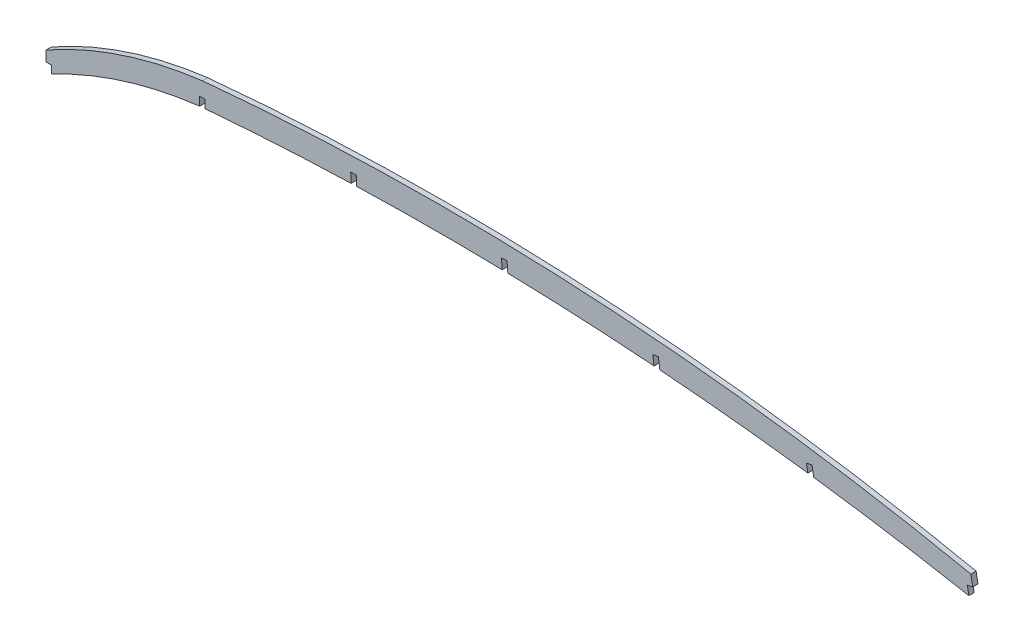
ISO-10303-21;
HEADER;
FILE_DESCRIPTION(('STEP AP214'),'2;1');
FILE_NAME('part.step','',(''),(''),'','','');
FILE_SCHEMA(('AUTOMOTIVE_DESIGN { 1 0 10303 214 1 1 1 1 }'));
ENDSEC;
DATA;
#1=APPLICATION_CONTEXT('core data for automotive mechanical design processes');
#2=APPLICATION_PROTOCOL_DEFINITION('international standard','automotive_design',2000,#1);
#3=PRODUCT_CONTEXT('',#1,'mechanical');
#4=PRODUCT('Part','Part','',(#3));
#5=PRODUCT_RELATED_PRODUCT_CATEGORY('part','',(#4));
#6=PRODUCT_DEFINITION_FORMATION('','',#4);
#7=PRODUCT_DEFINITION_CONTEXT('part definition',#1,'design');
#8=PRODUCT_DEFINITION('design','',#6,#7);
#9=PRODUCT_DEFINITION_SHAPE('','',#8);
#10=(LENGTH_UNIT() NAMED_UNIT(*) SI_UNIT(.MILLI.,.METRE.));
#11=(NAMED_UNIT(*) PLANE_ANGLE_UNIT() SI_UNIT($,.RADIAN.));
#12=(NAMED_UNIT(*) SI_UNIT($,.STERADIAN.) SOLID_ANGLE_UNIT());
#13=UNCERTAINTY_MEASURE_WITH_UNIT(LENGTH_MEASURE(1.E-05),#10,'distance_accuracy_value','');
#14=(GEOMETRIC_REPRESENTATION_CONTEXT(3) GLOBAL_UNCERTAINTY_ASSIGNED_CONTEXT((#13)) GLOBAL_UNIT_ASSIGNED_CONTEXT((#10,
#11,#12)) REPRESENTATION_CONTEXT('',''));
#15=CARTESIAN_POINT('',(0.,0.,0.));
#16=DIRECTION('',(0.,0.,1.));
#17=DIRECTION('',(1.,0.,0.));
#18=AXIS2_PLACEMENT_3D('',#15,#16,#17);
#19=CARTESIAN_POINT('',(236.848565858002,-1577.85111526632,3.175));
#20=DIRECTION('',(0.,0.,-1.));
#21=DIRECTION('',(-1.,0.,0.));
#22=AXIS2_PLACEMENT_3D('',#19,#20,#21);
#23=CYLINDRICAL_SURFACE('',#22,1707.63280925276);
#24=CARTESIAN_POINT('',(236.848565858002,-1577.85111526632,0.));
#25=DIRECTION('',(0.,0.,1.));
#26=DIRECTION('',(1.,0.,0.));
#27=AXIS2_PLACEMENT_3D('',#24,#25,#26);
#28=CIRCLE('',#27,1707.63280925276);
#29=CARTESIAN_POINT('',(186.671482616281,129.044333070749,0.));
#30=VERTEX_POINT('',#29);
#31=CARTESIAN_POINT('',(274.098105392822,129.375373235102,0.));
#32=VERTEX_POINT('',#31);
#33=EDGE_CURVE('E373',#30,#32,#28,.F.);
#34=ORIENTED_EDGE('',*,*,#33,.T.);
#35=DIRECTION('',(0.,0.,-1.));
#36=VECTOR('',#35,1.);
#37=CARTESIAN_POINT('',(274.098105392822,129.375373235101,3.175));
#38=LINE('',#37,#36);
#39=CARTESIAN_POINT('',(274.098105392822,129.375373235102,3.175));
#40=VERTEX_POINT('',#39);
#41=EDGE_CURVE('E299',#32,#40,#38,.F.);
#42=ORIENTED_EDGE('',*,*,#41,.T.);
#43=CARTESIAN_POINT('',(236.848565858002,-1577.85111526632,3.175));
#44=DIRECTION('',(0.,0.,1.));
#45=DIRECTION('',(1.,0.,0.));
#46=AXIS2_PLACEMENT_3D('',#43,#44,#45);
#47=CIRCLE('',#46,1707.63280925276);
#48=CARTESIAN_POINT('',(186.671482616281,129.044333070749,3.175));
#49=VERTEX_POINT('',#48);
#50=EDGE_CURVE('E375',#49,#40,#47,.F.);
#51=ORIENTED_EDGE('',*,*,#50,.F.);
#52=DIRECTION('',(0.,0.,-1.));
#53=VECTOR('',#52,1.);
#54=CARTESIAN_POINT('',(186.671482616281,129.044333070749,3.175));
#55=LINE('',#54,#53);
#56=EDGE_CURVE('E306',#49,#30,#55,.T.);
#57=ORIENTED_EDGE('',*,*,#56,.T.);
#58=EDGE_LOOP('',(#34,#42,#51,#57));
#59=FACE_BOUND('',#58,.T.);
#60=ADVANCED_FACE('F39',(#59),#23,.F.);
#61=CARTESIAN_POINT('',(95.6691,123.93564271968,0.));
#62=VERTEX_POINT('',#61);
#63=CARTESIAN_POINT('',(183.294622404811,128.941721130957,0.));
#64=VERTEX_POINT('',#63);
#65=EDGE_CURVE('E333',#62,#64,#28,.F.);
#66=ORIENTED_EDGE('',*,*,#65,.T.);
#67=DIRECTION('',(0.,0.,-1.));
#68=VECTOR('',#67,1.);
#69=CARTESIAN_POINT('',(183.294622404811,128.941721130957,3.175));
#70=LINE('',#69,#68);
#71=CARTESIAN_POINT('',(183.294622404811,128.941721130957,3.175));
#72=VERTEX_POINT('',#71);
#73=EDGE_CURVE('E300',#64,#72,#70,.F.);
#74=ORIENTED_EDGE('',*,*,#73,.T.);
#75=CARTESIAN_POINT('',(95.6691,123.93564271968,3.175));
#76=VERTEX_POINT('',#75);
#77=EDGE_CURVE('E316',#76,#72,#47,.F.);
#78=ORIENTED_EDGE('',*,*,#77,.F.);
#79=DIRECTION('',(0.,0.,-1.));
#80=VECTOR('',#79,1.);
#81=CARTESIAN_POINT('',(95.6691,123.93564271968,3.175));
#82=LINE('',#81,#80);
#83=EDGE_CURVE('E363',#76,#62,#82,.T.);
#84=ORIENTED_EDGE('',*,*,#83,.T.);
#85=EDGE_LOOP('',(#66,#74,#78,#84));
#86=FACE_BOUND('',#85,.T.);
#87=ADVANCED_FACE('F518',(#86),#23,.F.);
#88=CARTESIAN_POINT('',(368.77346378483,124.678071720924,0.));
#89=VERTEX_POINT('',#88);
#90=CARTESIAN_POINT('',(457.732770478867,115.435623412471,0.));
#91=VERTEX_POINT('',#90);
#92=EDGE_CURVE('E332',#89,#91,#28,.F.);
#93=ORIENTED_EDGE('',*,*,#92,.T.);
#94=DIRECTION('',(0.,0.,-1.));
#95=VECTOR('',#94,1.);
#96=CARTESIAN_POINT('',(457.732770478868,115.435623412472,3.175));
#97=LINE('',#96,#95);
#98=CARTESIAN_POINT('',(457.732770478867,115.435623412471,3.175));
#99=VERTEX_POINT('',#98);
#100=EDGE_CURVE('E360',#91,#99,#97,.F.);
#101=ORIENTED_EDGE('',*,*,#100,.T.);
#102=CARTESIAN_POINT('',(368.77346378483,124.678071720924,3.175));
#103=VERTEX_POINT('',#102);
#104=EDGE_CURVE('E315',#103,#99,#47,.F.);
#105=ORIENTED_EDGE('',*,*,#104,.F.);
#106=DIRECTION('',(0.,0.,-1.));
#107=VECTOR('',#106,1.);
#108=CARTESIAN_POINT('',(368.77346378483,124.678071720924,3.175));
#109=LINE('',#108,#107);
#110=EDGE_CURVE('E238',#103,#89,#109,.T.);
#111=ORIENTED_EDGE('',*,*,#110,.T.);
#112=EDGE_LOOP('',(#93,#101,#105,#111));
#113=FACE_BOUND('',#112,.T.);
#114=ADVANCED_FACE('F386',(#113),#23,.F.);
#115=CARTESIAN_POINT('',(277.495469966465,129.29786488241,3.175));
#116=VERTEX_POINT('',#115);
#117=CARTESIAN_POINT('',(365.330558587539,124.941352646519,3.175));
#118=VERTEX_POINT('',#117);
#119=EDGE_CURVE('E298',#116,#118,#47,.F.);
#120=ORIENTED_EDGE('',*,*,#119,.F.);
#121=DIRECTION('',(0.,0.,-1.));
#122=VECTOR('',#121,1.);
#123=CARTESIAN_POINT('',(277.495469966465,129.297864882409,3.175));
#124=LINE('',#123,#122);
#125=CARTESIAN_POINT('',(277.495469966465,129.29786488241,0.));
#126=VERTEX_POINT('',#125);
#127=EDGE_CURVE('E290',#116,#126,#124,.T.);
#128=ORIENTED_EDGE('',*,*,#127,.T.);
#129=CARTESIAN_POINT('',(365.330558587539,124.941352646519,0.));
#130=VERTEX_POINT('',#129);
#131=EDGE_CURVE('E286',#126,#130,#28,.F.);
#132=ORIENTED_EDGE('',*,*,#131,.T.);
#133=DIRECTION('',(0.,0.,-1.));
#134=VECTOR('',#133,1.);
#135=CARTESIAN_POINT('',(365.330558587539,124.941352646519,3.175));
#136=LINE('',#135,#134);
#137=EDGE_CURVE('E350',#130,#118,#136,.F.);
#138=ORIENTED_EDGE('',*,*,#137,.T.);
#139=EDGE_LOOP('',(#120,#128,#132,#138));
#140=FACE_BOUND('',#139,.T.);
#141=ADVANCED_FACE('F295',(#140),#23,.F.);
#142=CARTESIAN_POINT('',(122.337166720402,-128.617434034682,3.175));
#143=DIRECTION('',(0.,0.,-1.));
#144=DIRECTION('',(-1.,0.,0.));
#145=AXIS2_PLACEMENT_3D('',#142,#143,#144);
#146=CYLINDRICAL_SURFACE('',#145,254.);
#147=CARTESIAN_POINT('',(122.337166720402,-128.617434034682,3.175));
#148=DIRECTION('',(0.,0.,1.));
#149=DIRECTION('',(1.,0.,0.));
#150=AXIS2_PLACEMENT_3D('',#147,#148,#149);
#151=CIRCLE('',#150,254.);
#152=CARTESIAN_POINT('',(3.3528,95.790053532344,3.175));
#153=VERTEX_POINT('',#152);
#154=CARTESIAN_POINT('',(92.2909,123.599182896413,3.175));
#155=VERTEX_POINT('',#154);
#156=EDGE_CURVE('E251',#153,#155,#151,.F.);
#157=ORIENTED_EDGE('',*,*,#156,.F.);
#158=DIRECTION('',(0.,0.,-1.));
#159=VECTOR('',#158,1.);
#160=CARTESIAN_POINT('',(3.3528,95.790053532344,3.175));
#161=LINE('',#160,#159);
#162=CARTESIAN_POINT('',(3.3528,95.790053532344,0.));
#163=VERTEX_POINT('',#162);
#164=EDGE_CURVE('E303',#153,#163,#161,.T.);
#165=ORIENTED_EDGE('',*,*,#164,.T.);
#166=CARTESIAN_POINT('',(122.337166720402,-128.617434034682,0.));
#167=DIRECTION('',(0.,0.,1.));
#168=DIRECTION('',(1.,0.,0.));
#169=AXIS2_PLACEMENT_3D('',#166,#167,#168);
#170=CIRCLE('',#169,254.);
#171=CARTESIAN_POINT('',(92.2909,123.599182896413,0.));
#172=VERTEX_POINT('',#171);
#173=EDGE_CURVE('E311',#163,#172,#170,.F.);
#174=ORIENTED_EDGE('',*,*,#173,.T.);
#175=DIRECTION('',(0.,0.,-1.));
#176=VECTOR('',#175,1.);
#177=CARTESIAN_POINT('',(92.2909,123.599182896413,3.175));
#178=LINE('',#177,#176);
#179=EDGE_CURVE('E366',#172,#155,#178,.F.);
#180=ORIENTED_EDGE('',*,*,#179,.T.);
#181=EDGE_LOOP('',(#157,#165,#174,#180));
#182=FACE_BOUND('',#181,.T.);
#183=ADVANCED_FACE('F41',(#182),#146,.F.);
#184=CARTESIAN_POINT('',(461.251045548048,114.972956616346,3.175));
#185=VERTEX_POINT('',#184);
#186=CARTESIAN_POINT('',(554.466577904352,99.9833848141185,3.175));
#187=VERTEX_POINT('',#186);
#188=EDGE_CURVE('E255',#185,#187,#47,.F.);
#189=ORIENTED_EDGE('',*,*,#188,.F.);
#190=DIRECTION('',(0.,0.,-1.));
#191=VECTOR('',#190,1.);
#192=CARTESIAN_POINT('',(461.251045548048,114.972956616346,3.175));
#193=LINE('',#192,#191);
#194=CARTESIAN_POINT('',(461.251045548048,114.972956616346,0.));
#195=VERTEX_POINT('',#194);
#196=EDGE_CURVE('E353',#185,#195,#193,.T.);
#197=ORIENTED_EDGE('',*,*,#196,.T.);
#198=CARTESIAN_POINT('',(554.466577904352,99.9833848141185,0.));
#199=VERTEX_POINT('',#198);
#200=EDGE_CURVE('E329',#195,#199,#28,.F.);
#201=ORIENTED_EDGE('',*,*,#200,.T.);
#202=DIRECTION('',(0.,0.,-1.));
#203=VECTOR('',#202,1.);
#204=CARTESIAN_POINT('',(554.466577904352,99.9833848141185,3.175));
#205=LINE('',#204,#203);
#206=EDGE_CURVE('E349',#199,#187,#205,.F.);
#207=ORIENTED_EDGE('',*,*,#206,.T.);
#208=EDGE_LOOP('',(#189,#197,#201,#207));
#209=FACE_BOUND('',#208,.T.);
#210=ADVANCED_FACE('F437',(#209),#23,.F.);
#211=CARTESIAN_POINT('',(557.491562532306,101.659512414379,3.175));
#212=DIRECTION('',(0.983777409779827,0.179393444715503,0.));
#213=DIRECTION('',(-0.179393444715503,0.983777409779827,0.));
#214=AXIS2_PLACEMENT_3D('',#211,#212,#213);
#215=PLANE('',#214);
#216=DIRECTION('',(0.,0.,1.));
#217=VECTOR('',#216,1.);
#218=CARTESIAN_POINT('',(556.764166066413,105.6484887799,3.175));
#219=LINE('',#218,#217);
#220=CARTESIAN_POINT('',(556.764166066413,105.6484887799,0.));
#221=VERTEX_POINT('',#220);
#222=CARTESIAN_POINT('',(556.764166066413,105.6484887799,3.175));
#223=VERTEX_POINT('',#222);
#224=EDGE_CURVE('E346',#221,#223,#219,.T.);
#225=ORIENTED_EDGE('',*,*,#224,.F.);
#226=DIRECTION('',(0.179393444715503,-0.983777409779827,0.));
#227=VECTOR('',#226,1.);
#228=CARTESIAN_POINT('',(557.491562532306,101.659512414379,0.));
#229=LINE('',#228,#227);
#230=CARTESIAN_POINT('',(555.638244478769,111.822940833397,0.));
#231=VERTEX_POINT('',#230);
#232=EDGE_CURVE('E334',#231,#221,#229,.T.);
#233=ORIENTED_EDGE('',*,*,#232,.F.);
#234=DIRECTION('',(0.,0.,-1.));
#235=VECTOR('',#234,1.);
#236=CARTESIAN_POINT('',(555.638244478769,111.822940833397,3.175));
#237=LINE('',#236,#235);
#238=CARTESIAN_POINT('',(555.638244478769,111.822940833397,3.175));
#239=VERTEX_POINT('',#238);
#240=EDGE_CURVE('E265',#239,#231,#237,.T.);
#241=ORIENTED_EDGE('',*,*,#240,.F.);
#242=DIRECTION('',(0.179393444715503,-0.983777409779827,0.));
#243=VECTOR('',#242,1.);
#244=CARTESIAN_POINT('',(557.491562532306,101.659512414379,3.175));
#245=LINE('',#244,#243);
#246=EDGE_CURVE('E317',#239,#223,#245,.T.);
#247=ORIENTED_EDGE('',*,*,#246,.T.);
#248=EDGE_LOOP('',(#225,#233,#241,#247));
#249=FACE_BOUND('',#248,.T.);
#250=ADVANCED_FACE('F345',(#249),#215,.T.);
#251=CARTESIAN_POINT('',(239.516480687623,-1398.7972273158,3.175));
#252=DIRECTION('',(0.,0.,-1.));
#253=DIRECTION('',(-1.,0.,0.));
#254=AXIS2_PLACEMENT_3D('',#251,#252,#253);
#255=CYLINDRICAL_SURFACE('',#254,1543.34256144303);
#256=CARTESIAN_POINT('',(239.516480687623,-1398.7972273158,0.));
#257=DIRECTION('',(0.,0.,1.));
#258=DIRECTION('',(1.,0.,0.));
#259=AXIS2_PLACEMENT_3D('',#256,#257,#258);
#260=CIRCLE('',#259,1543.34256144303);
#261=CARTESIAN_POINT('',(93.9799999999999,137.668,0.));
#262=VERTEX_POINT('',#261);
#263=EDGE_CURVE('E257',#262,#231,#260,.F.);
#264=ORIENTED_EDGE('',*,*,#263,.F.);
#265=DIRECTION('',(0.,0.,-1.));
#266=VECTOR('',#265,1.);
#267=CARTESIAN_POINT('',(93.9799999999999,137.668,3.175));
#268=LINE('',#267,#266);
#269=CARTESIAN_POINT('',(93.9799999999999,137.668,3.175));
#270=VERTEX_POINT('',#269);
#271=EDGE_CURVE('E262',#270,#262,#268,.T.);
#272=ORIENTED_EDGE('',*,*,#271,.F.);
#273=CARTESIAN_POINT('',(239.516480687623,-1398.7972273158,3.175));
#274=DIRECTION('',(0.,0.,1.));
#275=DIRECTION('',(1.,0.,0.));
#276=AXIS2_PLACEMENT_3D('',#273,#274,#275);
#277=CIRCLE('',#276,1543.34256144303);
#278=EDGE_CURVE('E320',#270,#239,#277,.F.);
#279=ORIENTED_EDGE('',*,*,#278,.T.);
#280=ORIENTED_EDGE('',*,*,#240,.T.);
#281=EDGE_LOOP('',(#264,#272,#279,#280));
#282=FACE_BOUND('',#281,.T.);
#283=ADVANCED_FACE('F340',(#282),#255,.T.);
#284=CARTESIAN_POINT('',(125.005388450822,-114.430046941018,3.175));
#285=DIRECTION('',(0.,0.,-1.));
#286=DIRECTION('',(-1.,0.,0.));
#287=AXIS2_PLACEMENT_3D('',#284,#285,#286);
#288=CYLINDRICAL_SURFACE('',#287,254.);
#289=CARTESIAN_POINT('',(125.005388450822,-114.430046941018,0.));
#290=DIRECTION('',(0.,0.,1.));
#291=DIRECTION('',(1.,0.,0.));
#292=AXIS2_PLACEMENT_3D('',#289,#290,#291);
#293=CIRCLE('',#292,254.);
#294=CARTESIAN_POINT('',(0.,106.68,0.));
#295=VERTEX_POINT('',#294);
#296=EDGE_CURVE('E252',#295,#262,#293,.F.);
#297=ORIENTED_EDGE('',*,*,#296,.F.);
#298=DIRECTION('',(0.,0.,-1.));
#299=VECTOR('',#298,1.);
#300=CARTESIAN_POINT('',(0.,106.68,3.175));
#301=LINE('',#300,#299);
#302=CARTESIAN_POINT('',(0.,106.68,3.175));
#303=VERTEX_POINT('',#302);
#304=EDGE_CURVE('E250',#303,#295,#301,.T.);
#305=ORIENTED_EDGE('',*,*,#304,.F.);
#306=CARTESIAN_POINT('',(125.005388450822,-114.430046941018,3.175));
#307=DIRECTION('',(0.,0.,1.));
#308=DIRECTION('',(1.,0.,0.));
#309=AXIS2_PLACEMENT_3D('',#306,#307,#308);
#310=CIRCLE('',#309,254.);
#311=EDGE_CURVE('E323',#303,#270,#310,.F.);
#312=ORIENTED_EDGE('',*,*,#311,.T.);
#313=ORIENTED_EDGE('',*,*,#271,.T.);
#314=EDGE_LOOP('',(#297,#305,#312,#313));
#315=FACE_BOUND('',#314,.T.);
#316=ADVANCED_FACE('F508',(#315),#288,.T.);
#317=CARTESIAN_POINT('',(7.23067605790107E-13,0.,3.175));
#318=DIRECTION('',(1.,0.,0.));
#319=DIRECTION('',(0.,1.,0.));
#320=AXIS2_PLACEMENT_3D('',#317,#318,#319);
#321=PLANE('',#320);
#322=DIRECTION('',(0.,-1.,0.));
#323=VECTOR('',#322,1.);
#324=CARTESIAN_POINT('',(7.23067605790107E-13,0.,0.));
#325=LINE('',#324,#323);
#326=CARTESIAN_POINT('',(0.,100.457,0.));
#327=VERTEX_POINT('',#326);
#328=EDGE_CURVE('E245',#295,#327,#325,.T.);
#329=ORIENTED_EDGE('',*,*,#328,.T.);
#330=DIRECTION('',(0.,0.,1.));
#331=VECTOR('',#330,1.);
#332=CARTESIAN_POINT('',(0.,100.457,0.));
#333=LINE('',#332,#331);
#334=CARTESIAN_POINT('',(0.,100.457,3.175));
#335=VERTEX_POINT('',#334);
#336=EDGE_CURVE('E230',#327,#335,#333,.T.);
#337=ORIENTED_EDGE('',*,*,#336,.T.);
#338=DIRECTION('',(0.,-1.,0.));
#339=VECTOR('',#338,1.);
#340=CARTESIAN_POINT('',(7.23067605790107E-13,0.,3.175));
#341=LINE('',#340,#339);
#342=EDGE_CURVE('E263',#303,#335,#341,.T.);
#343=ORIENTED_EDGE('',*,*,#342,.F.);
#344=ORIENTED_EDGE('',*,*,#304,.T.);
#345=EDGE_LOOP('',(#329,#337,#343,#344));
#346=FACE_BOUND('',#345,.T.);
#347=ADVANCED_FACE('F249',(#346),#321,.F.);
#348=CARTESIAN_POINT('',(0.,0.,3.175));
#349=DIRECTION('',(0.,0.,1.));
#350=DIRECTION('',(1.,0.,0.));
#351=AXIS2_PLACEMENT_3D('',#348,#349,#350);
#352=PLANE('',#351);
#353=DIRECTION('',(-1.,0.,0.));
#354=VECTOR('',#353,1.);
#355=CARTESIAN_POINT('',(0.,100.457,3.175));
#356=LINE('',#355,#354);
#357=CARTESIAN_POINT('',(3.3528,100.457,3.175));
#358=VERTEX_POINT('',#357);
#359=EDGE_CURVE('E233',#358,#335,#356,.T.);
#360=ORIENTED_EDGE('',*,*,#359,.F.);
#361=DIRECTION('',(0.,1.,0.));
#362=VECTOR('',#361,1.);
#363=CARTESIAN_POINT('',(3.3528,93.98,3.175));
#364=LINE('',#363,#362);
#365=EDGE_CURVE('E463',#153,#358,#364,.T.);
#366=ORIENTED_EDGE('',*,*,#365,.F.);
#367=ORIENTED_EDGE('',*,*,#156,.T.);
#368=DIRECTION('',(0.,-1.,0.));
#369=VECTOR('',#368,1.);
#370=CARTESIAN_POINT('',(92.2909,128.848746883729,3.175));
#371=LINE('',#370,#369);
#372=CARTESIAN_POINT('',(92.2909,128.848746883729,3.175));
#373=VERTEX_POINT('',#372);
#374=EDGE_CURVE('E461',#373,#155,#371,.T.);
#375=ORIENTED_EDGE('',*,*,#374,.F.);
#376=DIRECTION('',(-1.,0.,0.));
#377=VECTOR('',#376,1.);
#378=CARTESIAN_POINT('',(92.2909,128.848746883729,3.175));
#379=LINE('',#378,#377);
#380=CARTESIAN_POINT('',(95.6691,128.848746883729,3.175));
#381=VERTEX_POINT('',#380);
#382=EDGE_CURVE('E456',#381,#373,#379,.T.);
#383=ORIENTED_EDGE('',*,*,#382,.F.);
#384=DIRECTION('',(0.,1.,0.));
#385=VECTOR('',#384,1.);
#386=CARTESIAN_POINT('',(95.6691,128.848746883729,3.175));
#387=LINE('',#386,#385);
#388=EDGE_CURVE('E464',#76,#381,#387,.T.);
#389=ORIENTED_EDGE('',*,*,#388,.F.);
#390=ORIENTED_EDGE('',*,*,#77,.T.);
#391=DIRECTION('',(0.0417483675024306,-0.999128156850202,0.));
#392=VECTOR('',#391,1.);
#393=CARTESIAN_POINT('',(183.054551015444,134.687145422245,3.175));
#394=LINE('',#393,#392);
#395=CARTESIAN_POINT('',(183.054551015444,134.687145422245,3.175));
#396=VERTEX_POINT('',#395);
#397=EDGE_CURVE('E470',#396,#72,#394,.T.);
#398=ORIENTED_EDGE('',*,*,#397,.F.);
#399=DIRECTION('',(-0.999128156850202,-0.0417483675024315,0.));
#400=VECTOR('',#399,1.);
#401=CARTESIAN_POINT('',(183.054551015444,134.687145422245,3.175));
#402=LINE('',#401,#400);
#403=CARTESIAN_POINT('',(186.429805754916,134.828179757341,3.175));
#404=VERTEX_POINT('',#403);
#405=EDGE_CURVE('E488',#404,#396,#402,.T.);
#406=ORIENTED_EDGE('',*,*,#405,.F.);
#407=DIRECTION('',(-0.0417483675024306,0.999128156850202,0.));
#408=VECTOR('',#407,1.);
#409=CARTESIAN_POINT('',(186.429805754916,134.828179757341,3.175));
#410=LINE('',#409,#408);
#411=EDGE_CURVE('E493',#49,#404,#410,.T.);
#412=ORIENTED_EDGE('',*,*,#411,.F.);
#413=ORIENTED_EDGE('',*,*,#50,.T.);
#414=DIRECTION('',(0.0857626231153062,-0.996315598832208,0.));
#415=VECTOR('',#414,1.);
#416=CARTESIAN_POINT('',(273.5908301415,135.268456112403,3.175));
#417=LINE('',#416,#415);
#418=CARTESIAN_POINT('',(273.5908301415,135.268456112403,3.175));
#419=VERTEX_POINT('',#418);
#420=EDGE_CURVE('E476',#419,#40,#417,.T.);
#421=ORIENTED_EDGE('',*,*,#420,.F.);
#422=DIRECTION('',(-0.996315598832208,-0.0857626231153069,0.));
#423=VECTOR('',#422,1.);
#424=CARTESIAN_POINT('',(273.5908301415,135.268456112403,3.175));
#425=LINE('',#424,#423);
#426=CARTESIAN_POINT('',(276.956583497475,135.558179405811,3.175));
#427=VERTEX_POINT('',#426);
#428=EDGE_CURVE('E474',#427,#419,#425,.T.);
#429=ORIENTED_EDGE('',*,*,#428,.F.);
#430=DIRECTION('',(-0.0857626231153062,0.996315598832208,0.));
#431=VECTOR('',#430,1.);
#432=CARTESIAN_POINT('',(276.956583497475,135.558179405811,3.175));
#433=LINE('',#432,#431);
#434=EDGE_CURVE('E479',#116,#427,#433,.T.);
#435=ORIENTED_EDGE('',*,*,#434,.F.);
#436=ORIENTED_EDGE('',*,*,#119,.T.);
#437=DIRECTION('',(0.131758387385292,-0.99128186070039,0.));
#438=VECTOR('',#437,1.);
#439=CARTESIAN_POINT('',(364.577933431069,130.603714491719,3.175));
#440=LINE('',#439,#438);
#441=CARTESIAN_POINT('',(364.577933431069,130.603714491719,3.175));
#442=VERTEX_POINT('',#441);
#443=EDGE_CURVE('E418',#442,#118,#440,.T.);
#444=ORIENTED_EDGE('',*,*,#443,.F.);
#445=DIRECTION('',(-0.99128186070039,-0.131758387385291,0.));
#446=VECTOR('',#445,1.);
#447=CARTESIAN_POINT('',(364.577933431069,130.603714491719,3.175));
#448=LINE('',#447,#446);
#449=CARTESIAN_POINT('',(367.926681812887,131.048820675984,3.175));
#450=VERTEX_POINT('',#449);
#451=EDGE_CURVE('E412',#450,#442,#448,.T.);
#452=ORIENTED_EDGE('',*,*,#451,.F.);
#453=DIRECTION('',(-0.131758387385287,0.99128186070039,0.));
#454=VECTOR('',#453,1.);
#455=CARTESIAN_POINT('',(367.926681812887,131.048820675984,3.175));
#456=LINE('',#455,#454);
#457=EDGE_CURVE('E415',#103,#450,#456,.T.);
#458=ORIENTED_EDGE('',*,*,#457,.F.);
#459=ORIENTED_EDGE('',*,*,#104,.T.);
#460=DIRECTION('',(0.179393575249242,-0.983777385976774,0.));
#461=VECTOR('',#460,1.);
#462=CARTESIAN_POINT('',(456.854976278776,120.249363717228,3.175));
#463=LINE('',#462,#461);
#464=CARTESIAN_POINT('',(456.854976278776,120.249363717228,3.175));
#465=VERTEX_POINT('',#464);
#466=EDGE_CURVE('E427',#465,#99,#463,.T.);
#467=ORIENTED_EDGE('',*,*,#466,.F.);
#468=DIRECTION('',(-0.983777385976775,-0.17939357524924,0.));
#469=VECTOR('',#468,1.);
#470=CARTESIAN_POINT('',(456.854976278776,120.249363717228,3.175));
#471=LINE('',#470,#469);
#472=CARTESIAN_POINT('',(460.178373044082,120.855391093135,3.175));
#473=VERTEX_POINT('',#472);
#474=EDGE_CURVE('E396',#473,#465,#471,.T.);
#475=ORIENTED_EDGE('',*,*,#474,.F.);
#476=DIRECTION('',(-0.179393575249242,0.983777385976774,0.));
#477=VECTOR('',#476,1.);
#478=CARTESIAN_POINT('',(460.178373044082,120.855391093135,3.175));
#479=LINE('',#478,#477);
#480=EDGE_CURVE('E399',#185,#473,#479,.T.);
#481=ORIENTED_EDGE('',*,*,#480,.F.);
#482=ORIENTED_EDGE('',*,*,#188,.T.);
#483=DIRECTION('',(0.179393575515035,-0.983777385928306,0.));
#484=VECTOR('',#483,1.);
#485=CARTESIAN_POINT('',(553.540722527769,105.060688053699,3.175));
#486=LINE('',#485,#484);
#487=CARTESIAN_POINT('',(553.540722527769,105.060688053699,3.175));
#488=VERTEX_POINT('',#487);
#489=EDGE_CURVE('E411',#488,#187,#486,.T.);
#490=ORIENTED_EDGE('',*,*,#489,.F.);
#491=DIRECTION('',(-0.983777385928307,-0.179393575515032,0.));
#492=VECTOR('',#491,1.);
#493=CARTESIAN_POINT('',(553.540722527769,105.060688053699,3.175));
#494=LINE('',#493,#492);
#495=EDGE_CURVE('E428',#223,#488,#494,.T.);
#496=ORIENTED_EDGE('',*,*,#495,.F.);
#497=ORIENTED_EDGE('',*,*,#246,.F.);
#498=ORIENTED_EDGE('',*,*,#278,.F.);
#499=ORIENTED_EDGE('',*,*,#311,.F.);
#500=ORIENTED_EDGE('',*,*,#342,.T.);
#501=EDGE_LOOP('',(#360,#366,#367,#375,#383,#389,#390,#398,#406,#412,#413,#421,#429,#435,#436,
#444,#452,#458,#459,#467,#475,#481,#482,#490,#496,#497,#498,#499,#500));
#502=FACE_BOUND('',#501,.T.);
#503=ADVANCED_FACE('F445',(#502),#352,.T.);
#504=CARTESIAN_POINT('',(0.,0.,0.));
#505=DIRECTION('',(0.,0.,1.));
#506=DIRECTION('',(1.,0.,0.));
#507=AXIS2_PLACEMENT_3D('',#504,#505,#506);
#508=PLANE('',#507);
#509=DIRECTION('',(0.,1.,0.));
#510=VECTOR('',#509,1.);
#511=CARTESIAN_POINT('',(3.35279999999999,0.,0.));
#512=LINE('',#511,#510);
#513=CARTESIAN_POINT('',(3.3528,100.457,0.));
#514=VERTEX_POINT('',#513);
#515=EDGE_CURVE('E11',#163,#514,#512,.T.);
#516=ORIENTED_EDGE('',*,*,#515,.T.);
#517=DIRECTION('',(-1.,0.,0.));
#518=VECTOR('',#517,1.);
#519=CARTESIAN_POINT('',(0.,100.457,0.));
#520=LINE('',#519,#518);
#521=EDGE_CURVE('E54',#514,#327,#520,.T.);
#522=ORIENTED_EDGE('',*,*,#521,.T.);
#523=ORIENTED_EDGE('',*,*,#328,.F.);
#524=ORIENTED_EDGE('',*,*,#296,.T.);
#525=ORIENTED_EDGE('',*,*,#263,.T.);
#526=ORIENTED_EDGE('',*,*,#232,.T.);
#527=DIRECTION('',(-0.983777385928307,-0.179393575515032,0.));
#528=VECTOR('',#527,1.);
#529=CARTESIAN_POINT('',(-0.727383479957659,3.98890214672275,0.));
#530=LINE('',#529,#528);
#531=CARTESIAN_POINT('',(553.540722527769,105.060688053699,0.));
#532=VERTEX_POINT('',#531);
#533=EDGE_CURVE('E270',#221,#532,#530,.T.);
#534=ORIENTED_EDGE('',*,*,#533,.T.);
#535=DIRECTION('',(0.179393575515035,-0.983777385928306,0.));
#536=VECTOR('',#535,1.);
#537=CARTESIAN_POINT('',(553.540722527769,105.060688053699,0.));
#538=LINE('',#537,#536);
#539=EDGE_CURVE('E426',#532,#199,#538,.T.);
#540=ORIENTED_EDGE('',*,*,#539,.T.);
#541=ORIENTED_EDGE('',*,*,#200,.F.);
#542=DIRECTION('',(-0.179393575249242,0.983777385976774,0.));
#543=VECTOR('',#542,1.);
#544=CARTESIAN_POINT('',(466.697850787917,85.1031922540635,0.));
#545=LINE('',#544,#543);
#546=CARTESIAN_POINT('',(460.178373044082,120.855391093135,0.));
#547=VERTEX_POINT('',#546);
#548=EDGE_CURVE('E273',#195,#547,#545,.T.);
#549=ORIENTED_EDGE('',*,*,#548,.T.);
#550=DIRECTION('',(-0.983777385976775,-0.17939357524924,0.));
#551=VECTOR('',#550,1.);
#552=CARTESIAN_POINT('',(456.854976278776,120.249363717228,0.));
#553=LINE('',#552,#551);
#554=CARTESIAN_POINT('',(456.854976278776,120.249363717228,0.));
#555=VERTEX_POINT('',#554);
#556=EDGE_CURVE('E394',#547,#555,#553,.T.);
#557=ORIENTED_EDGE('',*,*,#556,.T.);
#558=DIRECTION('',(0.179393575249242,-0.983777385976774,0.));
#559=VECTOR('',#558,1.);
#560=CARTESIAN_POINT('',(456.854976278776,120.249363717228,0.));
#561=LINE('',#560,#559);
#562=EDGE_CURVE('E393',#555,#91,#561,.T.);
#563=ORIENTED_EDGE('',*,*,#562,.T.);
#564=ORIENTED_EDGE('',*,*,#92,.F.);
#565=DIRECTION('',(-0.131758387385287,0.991281860700391,0.));
#566=VECTOR('',#565,1.);
#567=CARTESIAN_POINT('',(378.655621379288,50.329836573483,0.));
#568=LINE('',#567,#566);
#569=CARTESIAN_POINT('',(367.926681812887,131.048820675984,0.));
#570=VERTEX_POINT('',#569);
#571=EDGE_CURVE('E267',#89,#570,#568,.T.);
#572=ORIENTED_EDGE('',*,*,#571,.T.);
#573=DIRECTION('',(-0.99128186070039,-0.131758387385291,0.));
#574=VECTOR('',#573,1.);
#575=CARTESIAN_POINT('',(364.577933431069,130.603714491719,0.));
#576=LINE('',#575,#574);
#577=CARTESIAN_POINT('',(364.577933431069,130.603714491719,0.));
#578=VERTEX_POINT('',#577);
#579=EDGE_CURVE('E408',#570,#578,#576,.T.);
#580=ORIENTED_EDGE('',*,*,#579,.T.);
#581=DIRECTION('',(0.131758387385292,-0.99128186070039,0.));
#582=VECTOR('',#581,1.);
#583=CARTESIAN_POINT('',(364.577933431069,130.603714491719,0.));
#584=LINE('',#583,#582);
#585=EDGE_CURVE('E416',#578,#130,#584,.T.);
#586=ORIENTED_EDGE('',*,*,#585,.T.);
#587=ORIENTED_EDGE('',*,*,#131,.F.);
#588=DIRECTION('',(-0.0857626231153062,0.996315598832208,0.));
#589=VECTOR('',#588,1.);
#590=CARTESIAN_POINT('',(286.502495658872,24.6620705182039,0.));
#591=LINE('',#590,#589);
#592=CARTESIAN_POINT('',(276.956583497475,135.558179405811,0.));
#593=VERTEX_POINT('',#592);
#594=EDGE_CURVE('E47',#126,#593,#591,.T.);
#595=ORIENTED_EDGE('',*,*,#594,.T.);
#596=DIRECTION('',(-0.996315598832208,-0.0857626231153069,0.));
#597=VECTOR('',#596,1.);
#598=CARTESIAN_POINT('',(273.5908301415,135.268456112403,0.));
#599=LINE('',#598,#597);
#600=CARTESIAN_POINT('',(273.5908301415,135.268456112403,0.));
#601=VERTEX_POINT('',#600);
#602=EDGE_CURVE('E62',#593,#601,#599,.T.);
#603=ORIENTED_EDGE('',*,*,#602,.T.);
#604=DIRECTION('',(0.0857626231153062,-0.996315598832208,0.));
#605=VECTOR('',#604,1.);
#606=CARTESIAN_POINT('',(273.5908301415,135.268456112403,0.));
#607=LINE('',#606,#605);
#608=EDGE_CURVE('E380',#601,#32,#607,.T.);
#609=ORIENTED_EDGE('',*,*,#608,.T.);
#610=ORIENTED_EDGE('',*,*,#33,.F.);
#611=DIRECTION('',(-0.0417483675024306,0.999128156850202,0.));
#612=VECTOR('',#611,1.);
#613=CARTESIAN_POINT('',(191.728821282335,8.01134993226182,0.));
#614=LINE('',#613,#612);
#615=CARTESIAN_POINT('',(186.429805754916,134.828179757341,0.));
#616=VERTEX_POINT('',#615);
#617=EDGE_CURVE('E279',#30,#616,#614,.T.);
#618=ORIENTED_EDGE('',*,*,#617,.T.);
#619=DIRECTION('',(-0.999128156850202,-0.0417483675024315,0.));
#620=VECTOR('',#619,1.);
#621=CARTESIAN_POINT('',(183.054551015444,134.687145422245,0.));
#622=LINE('',#621,#620);
#623=CARTESIAN_POINT('',(183.054551015444,134.687145422245,0.));
#624=VERTEX_POINT('',#623);
#625=EDGE_CURVE('E489',#616,#624,#622,.T.);
#626=ORIENTED_EDGE('',*,*,#625,.T.);
#627=DIRECTION('',(0.0417483675024306,-0.999128156850202,0.));
#628=VECTOR('',#627,1.);
#629=CARTESIAN_POINT('',(183.054551015444,134.687145422245,0.));
#630=LINE('',#629,#628);
#631=EDGE_CURVE('E485',#624,#64,#630,.T.);
#632=ORIENTED_EDGE('',*,*,#631,.T.);
#633=ORIENTED_EDGE('',*,*,#65,.F.);
#634=DIRECTION('',(0.,1.,0.));
#635=VECTOR('',#634,1.);
#636=CARTESIAN_POINT('',(95.6691,0.,0.));
#637=LINE('',#636,#635);
#638=CARTESIAN_POINT('',(95.6691,128.848746883729,0.));
#639=VERTEX_POINT('',#638);
#640=EDGE_CURVE('E276',#62,#639,#637,.T.);
#641=ORIENTED_EDGE('',*,*,#640,.T.);
#642=DIRECTION('',(-1.,0.,0.));
#643=VECTOR('',#642,1.);
#644=CARTESIAN_POINT('',(92.2909,128.848746883729,0.));
#645=LINE('',#644,#643);
#646=CARTESIAN_POINT('',(92.2909,128.848746883729,0.));
#647=VERTEX_POINT('',#646);
#648=EDGE_CURVE('E457',#639,#647,#645,.T.);
#649=ORIENTED_EDGE('',*,*,#648,.T.);
#650=DIRECTION('',(0.,-1.,0.));
#651=VECTOR('',#650,1.);
#652=CARTESIAN_POINT('',(92.2909,128.848746883729,0.));
#653=LINE('',#652,#651);
#654=EDGE_CURVE('E453',#647,#172,#653,.T.);
#655=ORIENTED_EDGE('',*,*,#654,.T.);
#656=ORIENTED_EDGE('',*,*,#173,.F.);
#657=EDGE_LOOP('',(#516,#522,#523,#524,#525,#526,#534,#540,#541,#549,#557,#563,#564,#572,#580,
#586,#587,#595,#603,#609,#610,#618,#626,#632,#633,#641,#649,#655,#656));
#658=FACE_BOUND('',#657,.T.);
#659=ADVANCED_FACE('F243',(#658),#508,.F.);
#660=CARTESIAN_POINT('',(364.577933431069,130.603714491719,0.));
#661=DIRECTION('',(-0.99128186070039,-0.131758387385292,0.));
#662=DIRECTION('',(0.131758387385292,-0.99128186070039,0.));
#663=AXIS2_PLACEMENT_3D('',#660,#661,#662);
#664=PLANE('',#663);
#665=ORIENTED_EDGE('',*,*,#585,.F.);
#666=DIRECTION('',(0.,0.,1.));
#667=VECTOR('',#666,1.);
#668=CARTESIAN_POINT('',(364.577933431069,130.603714491719,0.));
#669=LINE('',#668,#667);
#670=EDGE_CURVE('E409',#578,#442,#669,.T.);
#671=ORIENTED_EDGE('',*,*,#670,.T.);
#672=ORIENTED_EDGE('',*,*,#443,.T.);
#673=ORIENTED_EDGE('',*,*,#137,.F.);
#674=EDGE_LOOP('',(#665,#671,#672,#673));
#675=FACE_BOUND('',#674,.T.);
#676=ADVANCED_FACE('F595',(#675),#664,.F.);
#677=CARTESIAN_POINT('',(367.926681812887,131.048820675984,0.));
#678=DIRECTION('',(0.991281860700391,0.131758387385287,0.));
#679=DIRECTION('',(-0.131758387385287,0.991281860700391,0.));
#680=AXIS2_PLACEMENT_3D('',#677,#678,#679);
#681=PLANE('',#680);
#682=ORIENTED_EDGE('',*,*,#457,.T.);
#683=DIRECTION('',(0.,0.,1.));
#684=VECTOR('',#683,1.);
#685=CARTESIAN_POINT('',(367.926681812887,131.048820675984,0.));
#686=LINE('',#685,#684);
#687=EDGE_CURVE('E405',#570,#450,#686,.T.);
#688=ORIENTED_EDGE('',*,*,#687,.F.);
#689=ORIENTED_EDGE('',*,*,#571,.F.);
#690=ORIENTED_EDGE('',*,*,#110,.F.);
#691=EDGE_LOOP('',(#682,#688,#689,#690));
#692=FACE_BOUND('',#691,.T.);
#693=ADVANCED_FACE('F605',(#692),#681,.F.);
#694=CARTESIAN_POINT('',(364.577933431069,130.603714491719,0.));
#695=DIRECTION('',(-0.131758387385291,0.99128186070039,0.));
#696=DIRECTION('',(-0.99128186070039,-0.131758387385291,0.));
#697=AXIS2_PLACEMENT_3D('',#694,#695,#696);
#698=PLANE('',#697);
#699=ORIENTED_EDGE('',*,*,#451,.T.);
#700=ORIENTED_EDGE('',*,*,#670,.F.);
#701=ORIENTED_EDGE('',*,*,#579,.F.);
#702=ORIENTED_EDGE('',*,*,#687,.T.);
#703=EDGE_LOOP('',(#699,#700,#701,#702));
#704=FACE_BOUND('',#703,.T.);
#705=ADVANCED_FACE('F616',(#704),#698,.F.);
#706=CARTESIAN_POINT('',(553.540722527769,105.060688053699,0.));
#707=DIRECTION('',(-0.983777385928306,-0.179393575515035,0.));
#708=DIRECTION('',(0.179393575515035,-0.983777385928306,0.));
#709=AXIS2_PLACEMENT_3D('',#706,#707,#708);
#710=PLANE('',#709);
#711=ORIENTED_EDGE('',*,*,#539,.F.);
#712=DIRECTION('',(0.,0.,1.));
#713=VECTOR('',#712,1.);
#714=CARTESIAN_POINT('',(553.540722527769,105.060688053699,0.));
#715=LINE('',#714,#713);
#716=EDGE_CURVE('E423',#532,#488,#715,.T.);
#717=ORIENTED_EDGE('',*,*,#716,.T.);
#718=ORIENTED_EDGE('',*,*,#489,.T.);
#719=ORIENTED_EDGE('',*,*,#206,.F.);
#720=EDGE_LOOP('',(#711,#717,#718,#719));
#721=FACE_BOUND('',#720,.T.);
#722=ADVANCED_FACE('F627',(#721),#710,.F.);
#723=CARTESIAN_POINT('',(553.540722527769,105.060688053699,0.));
#724=DIRECTION('',(-0.179393575515032,0.983777385928307,0.));
#725=DIRECTION('',(-0.983777385928307,-0.179393575515032,0.));
#726=AXIS2_PLACEMENT_3D('',#723,#724,#725);
#727=PLANE('',#726);
#728=ORIENTED_EDGE('',*,*,#224,.T.);
#729=ORIENTED_EDGE('',*,*,#495,.T.);
#730=ORIENTED_EDGE('',*,*,#716,.F.);
#731=ORIENTED_EDGE('',*,*,#533,.F.);
#732=EDGE_LOOP('',(#728,#729,#730,#731));
#733=FACE_BOUND('',#732,.T.);
#734=ADVANCED_FACE('F638',(#733),#727,.F.);
#735=CARTESIAN_POINT('',(456.854976278776,120.249363717228,0.));
#736=DIRECTION('',(-0.983777385976774,-0.179393575249242,0.));
#737=DIRECTION('',(0.179393575249242,-0.983777385976774,0.));
#738=AXIS2_PLACEMENT_3D('',#735,#736,#737);
#739=PLANE('',#738);
#740=ORIENTED_EDGE('',*,*,#562,.F.);
#741=DIRECTION('',(0.,0.,1.));
#742=VECTOR('',#741,1.);
#743=CARTESIAN_POINT('',(456.854976278776,120.249363717228,0.));
#744=LINE('',#743,#742);
#745=EDGE_CURVE('E450',#555,#465,#744,.T.);
#746=ORIENTED_EDGE('',*,*,#745,.T.);
#747=ORIENTED_EDGE('',*,*,#466,.T.);
#748=ORIENTED_EDGE('',*,*,#100,.F.);
#749=EDGE_LOOP('',(#740,#746,#747,#748));
#750=FACE_BOUND('',#749,.T.);
#751=ADVANCED_FACE('F648',(#750),#739,.F.);
#752=CARTESIAN_POINT('',(460.178373044082,120.855391093135,0.));
#753=DIRECTION('',(0.983777385976774,0.179393575249242,0.));
#754=DIRECTION('',(-0.179393575249242,0.983777385976774,0.));
#755=AXIS2_PLACEMENT_3D('',#752,#753,#754);
#756=PLANE('',#755);
#757=ORIENTED_EDGE('',*,*,#480,.T.);
#758=DIRECTION('',(0.,0.,1.));
#759=VECTOR('',#758,1.);
#760=CARTESIAN_POINT('',(460.178373044082,120.855391093135,0.));
#761=LINE('',#760,#759);
#762=EDGE_CURVE('E401',#547,#473,#761,.T.);
#763=ORIENTED_EDGE('',*,*,#762,.F.);
#764=ORIENTED_EDGE('',*,*,#548,.F.);
#765=ORIENTED_EDGE('',*,*,#196,.F.);
#766=EDGE_LOOP('',(#757,#763,#764,#765));
#767=FACE_BOUND('',#766,.T.);
#768=ADVANCED_FACE('F440',(#767),#756,.F.);
#769=CARTESIAN_POINT('',(456.854976278776,120.249363717228,0.));
#770=DIRECTION('',(-0.17939357524924,0.983777385976774,0.));
#771=DIRECTION('',(-0.983777385976775,-0.17939357524924,0.));
#772=AXIS2_PLACEMENT_3D('',#769,#770,#771);
#773=PLANE('',#772);
#774=ORIENTED_EDGE('',*,*,#474,.T.);
#775=ORIENTED_EDGE('',*,*,#745,.F.);
#776=ORIENTED_EDGE('',*,*,#556,.F.);
#777=ORIENTED_EDGE('',*,*,#762,.T.);
#778=EDGE_LOOP('',(#774,#775,#776,#777));
#779=FACE_BOUND('',#778,.T.);
#780=ADVANCED_FACE('F667',(#779),#773,.F.);
#781=CARTESIAN_POINT('',(92.2909,128.848746883729,0.));
#782=DIRECTION('',(-1.,0.,0.));
#783=DIRECTION('',(0.,0.,1.));
#784=AXIS2_PLACEMENT_3D('',#781,#782,#783);
#785=PLANE('',#784);
#786=ORIENTED_EDGE('',*,*,#654,.F.);
#787=DIRECTION('',(0.,0.,1.));
#788=VECTOR('',#787,1.);
#789=CARTESIAN_POINT('',(92.2909,128.848746883729,0.));
#790=LINE('',#789,#788);
#791=EDGE_CURVE('E468',#647,#373,#790,.T.);
#792=ORIENTED_EDGE('',*,*,#791,.T.);
#793=ORIENTED_EDGE('',*,*,#374,.T.);
#794=ORIENTED_EDGE('',*,*,#179,.F.);
#795=EDGE_LOOP('',(#786,#792,#793,#794));
#796=FACE_BOUND('',#795,.T.);
#797=ADVANCED_FACE('F677',(#796),#785,.F.);
#798=CARTESIAN_POINT('',(95.6691,128.848746883729,0.));
#799=DIRECTION('',(1.,0.,0.));
#800=DIRECTION('',(0.,0.,-1.));
#801=AXIS2_PLACEMENT_3D('',#798,#799,#800);
#802=PLANE('',#801);
#803=ORIENTED_EDGE('',*,*,#388,.T.);
#804=DIRECTION('',(0.,0.,1.));
#805=VECTOR('',#804,1.);
#806=CARTESIAN_POINT('',(95.6691,128.848746883729,0.));
#807=LINE('',#806,#805);
#808=EDGE_CURVE('E460',#639,#381,#807,.T.);
#809=ORIENTED_EDGE('',*,*,#808,.F.);
#810=ORIENTED_EDGE('',*,*,#640,.F.);
#811=ORIENTED_EDGE('',*,*,#83,.F.);
#812=EDGE_LOOP('',(#803,#809,#810,#811));
#813=FACE_BOUND('',#812,.T.);
#814=ADVANCED_FACE('F688',(#813),#802,.F.);
#815=CARTESIAN_POINT('',(92.2909,128.848746883729,0.));
#816=DIRECTION('',(0.,1.,0.));
#817=DIRECTION('',(0.,0.,1.));
#818=AXIS2_PLACEMENT_3D('',#815,#816,#817);
#819=PLANE('',#818);
#820=ORIENTED_EDGE('',*,*,#382,.T.);
#821=ORIENTED_EDGE('',*,*,#791,.F.);
#822=ORIENTED_EDGE('',*,*,#648,.F.);
#823=ORIENTED_EDGE('',*,*,#808,.T.);
#824=EDGE_LOOP('',(#820,#821,#822,#823));
#825=FACE_BOUND('',#824,.T.);
#826=ADVANCED_FACE('F699',(#825),#819,.F.);
#827=CARTESIAN_POINT('',(183.054551015444,134.687145422245,0.));
#828=DIRECTION('',(-0.999128156850202,-0.0417483675024306,0.));
#829=DIRECTION('',(0.0417483675024306,-0.999128156850202,0.));
#830=AXIS2_PLACEMENT_3D('',#827,#828,#829);
#831=PLANE('',#830);
#832=ORIENTED_EDGE('',*,*,#631,.F.);
#833=DIRECTION('',(0.,0.,1.));
#834=VECTOR('',#833,1.);
#835=CARTESIAN_POINT('',(183.054551015444,134.687145422245,0.));
#836=LINE('',#835,#834);
#837=EDGE_CURVE('E478',#624,#396,#836,.T.);
#838=ORIENTED_EDGE('',*,*,#837,.T.);
#839=ORIENTED_EDGE('',*,*,#397,.T.);
#840=ORIENTED_EDGE('',*,*,#73,.F.);
#841=EDGE_LOOP('',(#832,#838,#839,#840));
#842=FACE_BOUND('',#841,.T.);
#843=ADVANCED_FACE('F710',(#842),#831,.F.);
#844=CARTESIAN_POINT('',(186.429805754916,134.828179757341,0.));
#845=DIRECTION('',(0.999128156850202,0.0417483675024306,0.));
#846=DIRECTION('',(-0.0417483675024306,0.999128156850202,0.));
#847=AXIS2_PLACEMENT_3D('',#844,#845,#846);
#848=PLANE('',#847);
#849=ORIENTED_EDGE('',*,*,#411,.T.);
#850=DIRECTION('',(0.,0.,1.));
#851=VECTOR('',#850,1.);
#852=CARTESIAN_POINT('',(186.429805754916,134.828179757341,0.));
#853=LINE('',#852,#851);
#854=EDGE_CURVE('E491',#616,#404,#853,.T.);
#855=ORIENTED_EDGE('',*,*,#854,.F.);
#856=ORIENTED_EDGE('',*,*,#617,.F.);
#857=ORIENTED_EDGE('',*,*,#56,.F.);
#858=EDGE_LOOP('',(#849,#855,#856,#857));
#859=FACE_BOUND('',#858,.T.);
#860=ADVANCED_FACE('F721',(#859),#848,.F.);
#861=CARTESIAN_POINT('',(183.054551015444,134.687145422245,0.));
#862=DIRECTION('',(-0.0417483675024315,0.999128156850202,0.));
#863=DIRECTION('',(-0.999128156850202,-0.0417483675024315,0.));
#864=AXIS2_PLACEMENT_3D('',#861,#862,#863);
#865=PLANE('',#864);
#866=ORIENTED_EDGE('',*,*,#405,.T.);
#867=ORIENTED_EDGE('',*,*,#837,.F.);
#868=ORIENTED_EDGE('',*,*,#625,.F.);
#869=ORIENTED_EDGE('',*,*,#854,.T.);
#870=EDGE_LOOP('',(#866,#867,#868,#869));
#871=FACE_BOUND('',#870,.T.);
#872=ADVANCED_FACE('F732',(#871),#865,.F.);
#873=CARTESIAN_POINT('',(273.5908301415,135.268456112403,0.));
#874=DIRECTION('',(-0.996315598832208,-0.0857626231153062,0.));
#875=DIRECTION('',(0.0857626231153062,-0.996315598832208,0.));
#876=AXIS2_PLACEMENT_3D('',#873,#874,#875);
#877=PLANE('',#876);
#878=ORIENTED_EDGE('',*,*,#608,.F.);
#879=DIRECTION('',(0.,0.,1.));
#880=VECTOR('',#879,1.);
#881=CARTESIAN_POINT('',(273.5908301415,135.268456112403,0.));
#882=LINE('',#881,#880);
#883=EDGE_CURVE('E420',#601,#419,#882,.T.);
#884=ORIENTED_EDGE('',*,*,#883,.T.);
#885=ORIENTED_EDGE('',*,*,#420,.T.);
#886=ORIENTED_EDGE('',*,*,#41,.F.);
#887=EDGE_LOOP('',(#878,#884,#885,#886));
#888=FACE_BOUND('',#887,.T.);
#889=ADVANCED_FACE('F742',(#888),#877,.F.);
#890=CARTESIAN_POINT('',(276.956583497475,135.558179405811,0.));
#891=DIRECTION('',(0.996315598832208,0.0857626231153062,0.));
#892=DIRECTION('',(-0.0857626231153062,0.996315598832208,0.));
#893=AXIS2_PLACEMENT_3D('',#890,#891,#892);
#894=PLANE('',#893);
#895=ORIENTED_EDGE('',*,*,#434,.T.);
#896=DIRECTION('',(0.,0.,1.));
#897=VECTOR('',#896,1.);
#898=CARTESIAN_POINT('',(276.956583497475,135.558179405811,0.));
#899=LINE('',#898,#897);
#900=EDGE_CURVE('E292',#593,#427,#899,.T.);
#901=ORIENTED_EDGE('',*,*,#900,.F.);
#902=ORIENTED_EDGE('',*,*,#594,.F.);
#903=ORIENTED_EDGE('',*,*,#127,.F.);
#904=EDGE_LOOP('',(#895,#901,#902,#903));
#905=FACE_BOUND('',#904,.T.);
#906=ADVANCED_FACE('F289',(#905),#894,.F.);
#907=CARTESIAN_POINT('',(273.5908301415,135.268456112403,0.));
#908=DIRECTION('',(-0.0857626231153069,0.996315598832208,0.));
#909=DIRECTION('',(-0.996315598832208,-0.0857626231153069,0.));
#910=AXIS2_PLACEMENT_3D('',#907,#908,#909);
#911=PLANE('',#910);
#912=ORIENTED_EDGE('',*,*,#428,.T.);
#913=ORIENTED_EDGE('',*,*,#883,.F.);
#914=ORIENTED_EDGE('',*,*,#602,.F.);
#915=ORIENTED_EDGE('',*,*,#900,.T.);
#916=EDGE_LOOP('',(#912,#913,#914,#915));
#917=FACE_BOUND('',#916,.T.);
#918=ADVANCED_FACE('F763',(#917),#911,.F.);
#919=CARTESIAN_POINT('',(3.3528,93.98,0.));
#920=DIRECTION('',(1.,0.,0.));
#921=DIRECTION('',(0.,1.,0.));
#922=AXIS2_PLACEMENT_3D('',#919,#920,#921);
#923=PLANE('',#922);
#924=ORIENTED_EDGE('',*,*,#365,.T.);
#925=DIRECTION('',(0.,0.,1.));
#926=VECTOR('',#925,1.);
#927=CARTESIAN_POINT('',(3.3528,100.457,0.));
#928=LINE('',#927,#926);
#929=EDGE_CURVE('E239',#514,#358,#928,.T.);
#930=ORIENTED_EDGE('',*,*,#929,.F.);
#931=ORIENTED_EDGE('',*,*,#515,.F.);
#932=ORIENTED_EDGE('',*,*,#164,.F.);
#933=EDGE_LOOP('',(#924,#930,#931,#932));
#934=FACE_BOUND('',#933,.T.);
#935=ADVANCED_FACE('F504',(#934),#923,.F.);
#936=CARTESIAN_POINT('',(0.,100.457,0.));
#937=DIRECTION('',(0.,1.,0.));
#938=DIRECTION('',(0.,0.,1.));
#939=AXIS2_PLACEMENT_3D('',#936,#937,#938);
#940=PLANE('',#939);
#941=ORIENTED_EDGE('',*,*,#359,.T.);
#942=ORIENTED_EDGE('',*,*,#336,.F.);
#943=ORIENTED_EDGE('',*,*,#521,.F.);
#944=ORIENTED_EDGE('',*,*,#929,.T.);
#945=EDGE_LOOP('',(#941,#942,#943,#944));
#946=FACE_BOUND('',#945,.T.);
#947=ADVANCED_FACE('F231',(#946),#940,.F.);
#948=CLOSED_SHELL('',(#60,#87,#114,#141,#183,#210,#250,#283,#316,#347,#503,#659,#676,#693,#705,
#722,#734,#751,#768,#780,#797,#814,#826,#843,#860,#872,#889,#906,#918,#935,#947));
#949=MANIFOLD_SOLID_BREP('B2',#948);
#950=ADVANCED_BREP_SHAPE_REPRESENTATION('',(#18,#949),#14);
#951=SHAPE_DEFINITION_REPRESENTATION(#9,#950);
ENDSEC;
END-ISO-10303-21;
